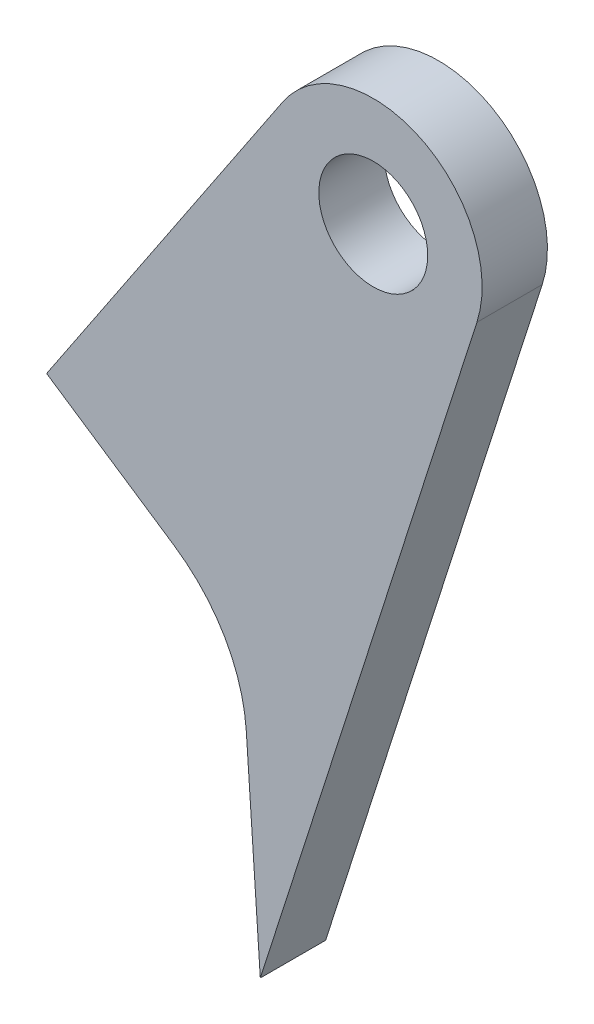
ISO-10303-21;
HEADER;
FILE_DESCRIPTION(('STEP AP214'),'2;1');
FILE_NAME('part.step','',(''),(''),'','','');
FILE_SCHEMA(('AUTOMOTIVE_DESIGN { 1 0 10303 214 1 1 1 1 }'));
ENDSEC;
DATA;
#1=APPLICATION_CONTEXT('core data for automotive mechanical design processes');
#2=APPLICATION_PROTOCOL_DEFINITION('international standard','automotive_design',2000,#1);
#3=PRODUCT_CONTEXT('',#1,'mechanical');
#4=PRODUCT('Part','Part','',(#3));
#5=PRODUCT_RELATED_PRODUCT_CATEGORY('part','',(#4));
#6=PRODUCT_DEFINITION_FORMATION('','',#4);
#7=PRODUCT_DEFINITION_CONTEXT('part definition',#1,'design');
#8=PRODUCT_DEFINITION('design','',#6,#7);
#9=PRODUCT_DEFINITION_SHAPE('','',#8);
#10=(LENGTH_UNIT() NAMED_UNIT(*) SI_UNIT(.MILLI.,.METRE.));
#11=(NAMED_UNIT(*) PLANE_ANGLE_UNIT() SI_UNIT($,.RADIAN.));
#12=(NAMED_UNIT(*) SI_UNIT($,.STERADIAN.) SOLID_ANGLE_UNIT());
#13=UNCERTAINTY_MEASURE_WITH_UNIT(LENGTH_MEASURE(1.E-05),#10,'distance_accuracy_value','');
#14=(GEOMETRIC_REPRESENTATION_CONTEXT(3) GLOBAL_UNCERTAINTY_ASSIGNED_CONTEXT((#13)) GLOBAL_UNIT_ASSIGNED_CONTEXT((#10,
#11,#12)) REPRESENTATION_CONTEXT('',''));
#15=CARTESIAN_POINT('',(0.,0.,0.));
#16=DIRECTION('',(0.,0.,1.));
#17=DIRECTION('',(1.,0.,0.));
#18=AXIS2_PLACEMENT_3D('',#15,#16,#17);
#19=CARTESIAN_POINT('',(19.6909706099776,7.97327954787157,8.99999999999999));
#20=DIRECTION('',(0.,0.,1.));
#21=DIRECTION('',(1.,0.,0.));
#22=AXIS2_PLACEMENT_3D('',#19,#20,#21);
#23=CYLINDRICAL_SURFACE('',#22,15.);
#24=CARTESIAN_POINT('',(19.6909706099776,7.97327954787157,15.));
#25=DIRECTION('',(0.,0.,-1.));
#26=DIRECTION('',(-1.,0.,0.));
#27=AXIS2_PLACEMENT_3D('',#24,#25,#26);
#28=CIRCLE('',#27,15.);
#29=CARTESIAN_POINT('',(28.0270311803392,20.4436481938765,15.));
#30=VERTEX_POINT('',#29);
#31=CARTESIAN_POINT('',(34.6567743568538,8.98556320870316,15.));
#32=VERTEX_POINT('',#31);
#33=EDGE_CURVE('E89',#30,#32,#28,.T.);
#34=ORIENTED_EDGE('',*,*,#33,.F.);
#35=DIRECTION('',(0.,0.,1.));
#36=VECTOR('',#35,1.);
#37=CARTESIAN_POINT('',(28.0270311803392,20.4436481938765,8.99999999999999));
#38=LINE('',#37,#36);
#39=CARTESIAN_POINT('',(28.0270311803392,20.4436481938765,8.99999999999999));
#40=VERTEX_POINT('',#39);
#41=EDGE_CURVE('E11',#40,#30,#38,.T.);
#42=ORIENTED_EDGE('',*,*,#41,.F.);
#43=CARTESIAN_POINT('',(19.6909706099776,7.97327954787157,8.99999999999999));
#44=DIRECTION('',(0.,0.,-1.));
#45=DIRECTION('',(-1.,0.,0.));
#46=AXIS2_PLACEMENT_3D('',#43,#44,#45);
#47=CIRCLE('',#46,15.);
#48=CARTESIAN_POINT('',(34.6567743568538,8.98556320870316,8.99999999999999));
#49=VERTEX_POINT('',#48);
#50=EDGE_CURVE('E90',#40,#49,#47,.T.);
#51=ORIENTED_EDGE('',*,*,#50,.T.);
#52=DIRECTION('',(0.,0.,1.));
#53=VECTOR('',#52,1.);
#54=CARTESIAN_POINT('',(34.6567743568538,8.98556320870316,8.99999999999999));
#55=LINE('',#54,#53);
#56=EDGE_CURVE('E39',#49,#32,#55,.T.);
#57=ORIENTED_EDGE('',*,*,#56,.T.);
#58=EDGE_LOOP('',(#34,#42,#51,#57));
#59=FACE_BOUND('',#58,.T.);
#60=ADVANCED_FACE('F36',(#59),#23,.F.);
#61=CARTESIAN_POINT('',(28.0270311803392,20.4436481938765,8.99999999999999));
#62=DIRECTION('',(0.55573737135744,0.831357909733661,0.));
#63=DIRECTION('',(-0.831357909733661,0.55573737135744,0.));
#64=AXIS2_PLACEMENT_3D('',#61,#62,#63);
#65=PLANE('',#64);
#66=DIRECTION('',(-0.831357909733661,0.55573737135744,0.));
#67=VECTOR('',#66,1.);
#68=CARTESIAN_POINT('',(28.0270311803392,20.4436481938765,15.));
#69=LINE('',#68,#67);
#70=CARTESIAN_POINT('',(16.3138832729534,28.2735298274763,15.));
#71=VERTEX_POINT('',#70);
#72=EDGE_CURVE('E105',#30,#71,#69,.T.);
#73=ORIENTED_EDGE('',*,*,#72,.T.);
#74=DIRECTION('',(0.,0.,1.));
#75=VECTOR('',#74,1.);
#76=CARTESIAN_POINT('',(16.3138832729534,28.2735298274763,8.99999999999999));
#77=LINE('',#76,#75);
#78=CARTESIAN_POINT('',(16.3138832729534,28.2735298274763,8.99999999999999));
#79=VERTEX_POINT('',#78);
#80=EDGE_CURVE('E44',#79,#71,#77,.T.);
#81=ORIENTED_EDGE('',*,*,#80,.F.);
#82=DIRECTION('',(-0.831357909733661,0.55573737135744,0.));
#83=VECTOR('',#82,1.);
#84=CARTESIAN_POINT('',(28.0270311803392,20.4436481938765,8.99999999999999));
#85=LINE('',#84,#83);
#86=EDGE_CURVE('E57',#40,#79,#85,.T.);
#87=ORIENTED_EDGE('',*,*,#86,.F.);
#88=ORIENTED_EDGE('',*,*,#41,.T.);
#89=EDGE_LOOP('',(#73,#81,#87,#88));
#90=FACE_BOUND('',#89,.T.);
#91=ADVANCED_FACE('F150',(#90),#65,.F.);
#92=CARTESIAN_POINT('',(16.3138832729534,28.2735298274763,8.99999999999999));
#93=DIRECTION('',(0.831357909733661,-0.555737371357441,0.));
#94=DIRECTION('',(0.555737371357441,0.831357909733661,0.));
#95=AXIS2_PLACEMENT_3D('',#92,#93,#94);
#96=PLANE('',#95);
#97=DIRECTION('',(0.555737371357441,0.831357909733661,0.));
#98=VECTOR('',#97,1.);
#99=CARTESIAN_POINT('',(16.3138832729534,28.2735298274763,15.));
#100=LINE('',#99,#98);
#101=CARTESIAN_POINT('',(38.0017088075618,60.7175334745219,15.));
#102=VERTEX_POINT('',#101);
#103=EDGE_CURVE('E117',#71,#102,#100,.T.);
#104=ORIENTED_EDGE('',*,*,#103,.T.);
#105=DIRECTION('',(0.,0.,1.));
#106=VECTOR('',#105,1.);
#107=CARTESIAN_POINT('',(38.0017088075618,60.7175334745219,8.99999999999999));
#108=LINE('',#107,#106);
#109=CARTESIAN_POINT('',(38.0017088075618,60.7175334745219,8.99999999999999));
#110=VERTEX_POINT('',#109);
#111=EDGE_CURVE('E135',#110,#102,#108,.T.);
#112=ORIENTED_EDGE('',*,*,#111,.F.);
#113=DIRECTION('',(0.555737371357441,0.831357909733661,0.));
#114=VECTOR('',#113,1.);
#115=CARTESIAN_POINT('',(16.3138832729534,28.2735298274763,8.99999999999999));
#116=LINE('',#115,#114);
#117=EDGE_CURVE('E130',#79,#110,#116,.T.);
#118=ORIENTED_EDGE('',*,*,#117,.F.);
#119=ORIENTED_EDGE('',*,*,#80,.T.);
#120=EDGE_LOOP('',(#104,#112,#118,#119));
#121=FACE_BOUND('',#120,.T.);
#122=ADVANCED_FACE('F147',(#121),#96,.F.);
#123=CARTESIAN_POINT('',(46.3152879048984,55.1601597609475,8.99999999999999));
#124=DIRECTION('',(0.,0.,1.));
#125=DIRECTION('',(1.,0.,0.));
#126=AXIS2_PLACEMENT_3D('',#123,#124,#125);
#127=CYLINDRICAL_SURFACE('',#126,10.);
#128=CARTESIAN_POINT('',(46.3152879048984,55.1601597609475,15.));
#129=DIRECTION('',(0.,0.,1.));
#130=DIRECTION('',(1.,0.,0.));
#131=AXIS2_PLACEMENT_3D('',#128,#129,#130);
#132=CIRCLE('',#131,10.);
#133=CARTESIAN_POINT('',(55.8385226925954,52.1092583894838,15.));
#134=VERTEX_POINT('',#133);
#135=EDGE_CURVE('E114',#134,#102,#132,.T.);
#136=ORIENTED_EDGE('',*,*,#135,.F.);
#137=DIRECTION('',(0.,0.,1.));
#138=VECTOR('',#137,1.);
#139=CARTESIAN_POINT('',(55.8385226925954,52.1092583894838,8.99999999999999));
#140=LINE('',#139,#138);
#141=CARTESIAN_POINT('',(55.8385226925954,52.1092583894838,8.99999999999999));
#142=VERTEX_POINT('',#141);
#143=EDGE_CURVE('E137',#142,#134,#140,.T.);
#144=ORIENTED_EDGE('',*,*,#143,.F.);
#145=CARTESIAN_POINT('',(46.3152879048984,55.1601597609475,8.99999999999999));
#146=DIRECTION('',(0.,0.,1.));
#147=DIRECTION('',(1.,0.,0.));
#148=AXIS2_PLACEMENT_3D('',#145,#146,#147);
#149=CIRCLE('',#148,10.);
#150=EDGE_CURVE('E127',#142,#110,#149,.T.);
#151=ORIENTED_EDGE('',*,*,#150,.T.);
#152=ORIENTED_EDGE('',*,*,#111,.T.);
#153=EDGE_LOOP('',(#136,#144,#151,#152));
#154=FACE_BOUND('',#153,.T.);
#155=ADVANCED_FACE('F144',(#154),#127,.T.);
#156=CARTESIAN_POINT('',(35.9409536600781,-10.,8.99999999999999));
#157=DIRECTION('',(0.952323478769693,-0.30509013714637,0.));
#158=DIRECTION('',(0.30509013714637,0.952323478769693,0.));
#159=AXIS2_PLACEMENT_3D('',#156,#157,#158);
#160=PLANE('',#159);
#161=DIRECTION('',(0.30509013714637,0.952323478769693,0.));
#162=VECTOR('',#161,1.);
#163=CARTESIAN_POINT('',(35.9409536600781,-10.,15.));
#164=LINE('',#163,#162);
#165=CARTESIAN_POINT('',(35.9409536600781,-10.,15.));
#166=VERTEX_POINT('',#165);
#167=EDGE_CURVE('E100',#166,#134,#164,.T.);
#168=ORIENTED_EDGE('',*,*,#167,.F.);
#169=DIRECTION('',(0.,0.,1.));
#170=VECTOR('',#169,1.);
#171=CARTESIAN_POINT('',(35.9409536600781,-10.,8.99999999999999));
#172=LINE('',#171,#170);
#173=CARTESIAN_POINT('',(35.9409536600781,-10.,8.99999999999999));
#174=VERTEX_POINT('',#173);
#175=EDGE_CURVE('E93',#174,#166,#172,.T.);
#176=ORIENTED_EDGE('',*,*,#175,.F.);
#177=DIRECTION('',(0.30509013714637,0.952323478769693,0.));
#178=VECTOR('',#177,1.);
#179=CARTESIAN_POINT('',(35.9409536600781,-10.,8.99999999999999));
#180=LINE('',#179,#178);
#181=EDGE_CURVE('E124',#174,#142,#180,.T.);
#182=ORIENTED_EDGE('',*,*,#181,.T.);
#183=ORIENTED_EDGE('',*,*,#143,.T.);
#184=EDGE_LOOP('',(#168,#176,#182,#183));
#185=FACE_BOUND('',#184,.T.);
#186=ADVANCED_FACE('F140',(#185),#160,.T.);
#187=CARTESIAN_POINT('',(35.9409536600781,-10.,8.99999999999999));
#188=DIRECTION('',(0.997720249791746,0.0674855773887732,0.));
#189=DIRECTION('',(-0.0674855773887733,0.997720249791746,0.));
#190=AXIS2_PLACEMENT_3D('',#187,#188,#189);
#191=PLANE('',#190);
#192=DIRECTION('',(-0.0674855773887733,0.997720249791746,0.));
#193=VECTOR('',#192,1.);
#194=CARTESIAN_POINT('',(35.9409536600781,-10.,15.));
#195=LINE('',#194,#193);
#196=EDGE_CURVE('E95',#166,#32,#195,.T.);
#197=ORIENTED_EDGE('',*,*,#196,.T.);
#198=ORIENTED_EDGE('',*,*,#56,.F.);
#199=DIRECTION('',(-0.0674855773887733,0.997720249791746,0.));
#200=VECTOR('',#199,1.);
#201=CARTESIAN_POINT('',(35.9409536600781,-10.,8.99999999999999));
#202=LINE('',#201,#200);
#203=EDGE_CURVE('E122',#174,#49,#202,.T.);
#204=ORIENTED_EDGE('',*,*,#203,.F.);
#205=ORIENTED_EDGE('',*,*,#175,.T.);
#206=EDGE_LOOP('',(#197,#198,#204,#205));
#207=FACE_BOUND('',#206,.T.);
#208=ADVANCED_FACE('F96',(#207),#191,.F.);
#209=CARTESIAN_POINT('',(19.6909706099776,7.97327954787157,8.99999999999999));
#210=DIRECTION('',(0.,0.,-1.));
#211=DIRECTION('',(-1.,0.,0.));
#212=AXIS2_PLACEMENT_3D('',#209,#210,#211);
#213=PLANE('',#212);
#214=CARTESIAN_POINT('',(46.3152879048984,55.1601597609475,8.99999999999999));
#215=DIRECTION('',(0.,0.,1.));
#216=DIRECTION('',(1.,0.,0.));
#217=AXIS2_PLACEMENT_3D('',#214,#215,#216);
#218=CIRCLE('',#217,5.);
#219=CARTESIAN_POINT('',(51.3152879048984,55.1601597609475,8.99999999999999));
#220=VERTEX_POINT('',#219);
#221=EDGE_CURVE('E106',#220,#220,#218,.T.);
#222=ORIENTED_EDGE('',*,*,#221,.T.);
#223=EDGE_LOOP('',(#222));
#224=FACE_BOUND('',#223,.T.);
#225=ORIENTED_EDGE('',*,*,#50,.F.);
#226=ORIENTED_EDGE('',*,*,#86,.T.);
#227=ORIENTED_EDGE('',*,*,#117,.T.);
#228=ORIENTED_EDGE('',*,*,#150,.F.);
#229=ORIENTED_EDGE('',*,*,#181,.F.);
#230=ORIENTED_EDGE('',*,*,#203,.T.);
#231=EDGE_LOOP('',(#225,#226,#227,#228,#229,#230));
#232=FACE_BOUND('',#231,.T.);
#233=ADVANCED_FACE('F151',(#224,#232),#213,.T.);
#234=CARTESIAN_POINT('',(19.6909706099776,7.97327954787157,15.));
#235=DIRECTION('',(0.,0.,-1.));
#236=DIRECTION('',(-1.,0.,0.));
#237=AXIS2_PLACEMENT_3D('',#234,#235,#236);
#238=PLANE('',#237);
#239=CARTESIAN_POINT('',(46.3152879048984,55.1601597609475,15.));
#240=DIRECTION('',(0.,0.,1.));
#241=DIRECTION('',(1.,0.,0.));
#242=AXIS2_PLACEMENT_3D('',#239,#240,#241);
#243=CIRCLE('',#242,5.);
#244=CARTESIAN_POINT('',(51.3152879048984,55.1601597609475,15.));
#245=VERTEX_POINT('',#244);
#246=EDGE_CURVE('E109',#245,#245,#243,.T.);
#247=ORIENTED_EDGE('',*,*,#246,.F.);
#248=EDGE_LOOP('',(#247));
#249=FACE_BOUND('',#248,.T.);
#250=ORIENTED_EDGE('',*,*,#33,.T.);
#251=ORIENTED_EDGE('',*,*,#196,.F.);
#252=ORIENTED_EDGE('',*,*,#167,.T.);
#253=ORIENTED_EDGE('',*,*,#135,.T.);
#254=ORIENTED_EDGE('',*,*,#103,.F.);
#255=ORIENTED_EDGE('',*,*,#72,.F.);
#256=EDGE_LOOP('',(#250,#251,#252,#253,#254,#255));
#257=FACE_BOUND('',#256,.T.);
#258=ADVANCED_FACE('F103',(#249,#257),#238,.F.);
#259=CARTESIAN_POINT('',(46.3152879048984,55.1601597609475,8.99999999999999));
#260=DIRECTION('',(0.,0.,1.));
#261=DIRECTION('',(1.,0.,0.));
#262=AXIS2_PLACEMENT_3D('',#259,#260,#261);
#263=CYLINDRICAL_SURFACE('',#262,5.);
#264=ORIENTED_EDGE('',*,*,#221,.F.);
#265=EDGE_LOOP('',(#264));
#266=FACE_BOUND('',#265,.T.);
#267=ORIENTED_EDGE('',*,*,#246,.T.);
#268=EDGE_LOOP('',(#267));
#269=FACE_BOUND('',#268,.T.);
#270=ADVANCED_FACE('F159',(#266,#269),#263,.F.);
#271=CLOSED_SHELL('',(#60,#91,#122,#155,#186,#208,#233,#258,#270));
#272=MANIFOLD_SOLID_BREP('B2',#271);
#273=ADVANCED_BREP_SHAPE_REPRESENTATION('',(#18,#272),#14);
#274=SHAPE_DEFINITION_REPRESENTATION(#9,#273);
ENDSEC;
END-ISO-10303-21;
